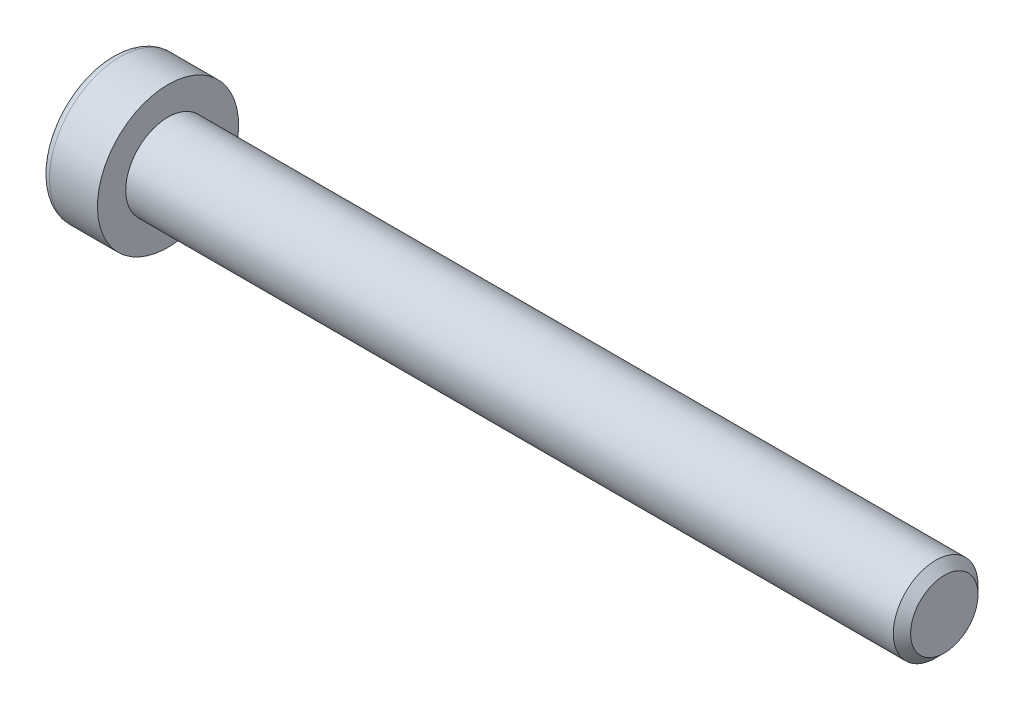
ISO-10303-21;
HEADER;
FILE_DESCRIPTION(('STEP AP214'),'2;1');
FILE_NAME('part.step','',(''),(''),'','','');
FILE_SCHEMA(('AUTOMOTIVE_DESIGN { 1 0 10303 214 1 1 1 1 }'));
ENDSEC;
DATA;
#1=APPLICATION_CONTEXT('core data for automotive mechanical design processes');
#2=APPLICATION_PROTOCOL_DEFINITION('international standard','automotive_design',2000,#1);
#3=PRODUCT_CONTEXT('',#1,'mechanical');
#4=PRODUCT('Part','Part','',(#3));
#5=PRODUCT_RELATED_PRODUCT_CATEGORY('part','',(#4));
#6=PRODUCT_DEFINITION_FORMATION('','',#4);
#7=PRODUCT_DEFINITION_CONTEXT('part definition',#1,'design');
#8=PRODUCT_DEFINITION('design','',#6,#7);
#9=PRODUCT_DEFINITION_SHAPE('','',#8);
#10=(LENGTH_UNIT() NAMED_UNIT(*) SI_UNIT(.MILLI.,.METRE.));
#11=(NAMED_UNIT(*) PLANE_ANGLE_UNIT() SI_UNIT($,.RADIAN.));
#12=(NAMED_UNIT(*) SI_UNIT($,.STERADIAN.) SOLID_ANGLE_UNIT());
#13=UNCERTAINTY_MEASURE_WITH_UNIT(LENGTH_MEASURE(1.E-05),#10,'distance_accuracy_value','');
#14=(GEOMETRIC_REPRESENTATION_CONTEXT(3) GLOBAL_UNCERTAINTY_ASSIGNED_CONTEXT((#13)) GLOBAL_UNIT_ASSIGNED_CONTEXT((#10,
#11,#12)) REPRESENTATION_CONTEXT('',''));
#15=CARTESIAN_POINT('',(0.,0.,0.));
#16=DIRECTION('',(0.,0.,1.));
#17=DIRECTION('',(1.,0.,0.));
#18=AXIS2_PLACEMENT_3D('',#15,#16,#17);
#19=CARTESIAN_POINT('',(-1.0080000013204,0.,0.));
#20=DIRECTION('',(-1.,0.,0.));
#21=DIRECTION('',(0.,0.,1.));
#22=AXIS2_PLACEMENT_3D('',#19,#20,#21);
#23=CONICAL_SURFACE('',#22,2.32325748231688,1.04719754987444);
#24=CARTESIAN_POINT('',(0.333333335277075,-1.13686837721616E-10,0.));
#25=VERTEX_POINT('',#24);
#26=VERTEX_LOOP('',#25);
#27=FACE_BOUND('',#26,.T.);
#28=CARTESIAN_POINT('',(-1.00000000147417,2.00000000033577,1.15470053795369));
#29=CARTESIAN_POINT('',(-0.970695546651424,2.00000000012059,1.05321634683343));
#30=CARTESIAN_POINT('',(-0.944044678605912,2.00000000003232,0.950856145634243));
#31=CARTESIAN_POINT('',(-0.89752638882102,1.9999999999676,0.744363444828041));
#32=CARTESIAN_POINT('',(-0.877675421693126,1.99999999999142,0.640227277439652));
#33=CARTESIAN_POINT('',(-0.846775960221252,2.00000000000837,0.433245449982703));
#34=CARTESIAN_POINT('',(-0.835521788855821,2.00000000000223,0.330431627800687));
#35=CARTESIAN_POINT('',(-0.822089169383493,1.99999999999777,0.124320462828436));
#36=CARTESIAN_POINT('',(-0.819899595237444,1.99999999999944,0.0210238686822163));
#37=CARTESIAN_POINT('',(-0.824466291464269,2.00000000000049,-0.171974735991148));
#38=CARTESIAN_POINT('',(-0.830101286550578,2.00000000000013,-0.261705707531802));
#39=CARTESIAN_POINT('',(-0.847957302108121,1.99999999999987,-0.440583082600117));
#40=CARTESIAN_POINT('',(-0.860184416189506,1.99999999999996,-0.529728867900473));
#41=CARTESIAN_POINT('',(-0.890749834827568,2.00000000000004,-0.70897474722998));
#42=CARTESIAN_POINT('',(-0.909217643745651,2.00000000000002,-0.799052166718215));
#43=CARTESIAN_POINT('',(-0.951131762446776,1.99999999999998,-0.977863889549757));
#44=CARTESIAN_POINT('',(-0.974568230401505,1.99999999999996,-1.06660048191082));
#45=CARTESIAN_POINT('',(-1.0000000016925,2.,-1.15470053794852));
#46=B_SPLINE_CURVE_WITH_KNOTS('',3,(#28,#29,#30,#31,#32,#33,#34,#35,#36,#37,#38,#39,#40,#41,#42,
#43,#44,#45),.UNSPECIFIED.,.F.,.F.,(4,2,2,2,2,2,2,2,4),(0.,0.317016011625951,0.634793817177001,
0.944707606346165,1.25424088912896,1.52370778261223,1.7934241935265,2.06912162198924,
2.3442779727795),.UNSPECIFIED.);
#47=CARTESIAN_POINT('',(-1.00000000167708,1.99999999979036,1.15470053825821));
#48=VERTEX_POINT('',#47);
#49=CARTESIAN_POINT('',(-1.00000000174696,2.,-1.15470053813718));
#50=VERTEX_POINT('',#49);
#51=EDGE_CURVE('E19',#48,#50,#46,.T.);
#52=ORIENTED_EDGE('',*,*,#51,.T.);
#53=CARTESIAN_POINT('',(-1.00000000147417,1.99999999979934,-1.15470053888282));
#54=CARTESIAN_POINT('',(-0.970695546651423,1.91211211209909,-1.2054426342566));
#55=CARTESIAN_POINT('',(-0.944044678605912,1.82346557747997,-1.25662273477975));
#56=CARTESIAN_POINT('',(-0.89752638882102,1.64463765285338,-1.3598690851268));
#57=CARTESIAN_POINT('',(-0.877675421693125,1.5544530864542,-1.41193716884162));
#58=CARTESIAN_POINT('',(-0.846775960221251,1.37520156576323,-1.51542808258477));
#59=CARTESIAN_POINT('',(-0.83552178885582,1.28616218389036,-1.56683499367046));
#60=CARTESIAN_POINT('',(-0.822089169383492,1.10766467901855,-1.66989057615273));
#61=CARTESIAN_POINT('',(-0.819899595237443,1.01820720436435,-1.72153887322728));
#62=CARTESIAN_POINT('',(-0.824466291464268,0.851065509822789,-1.81803817556487));
#63=CARTESIAN_POINT('',(-0.830101286550577,0.773356208962147,-1.86290366133489));
#64=CARTESIAN_POINT('',(-0.84795730210812,0.618443857990577,-1.95234234886882));
#65=CARTESIAN_POINT('',(-0.860184416189505,0.541241343280201,-1.99691524151908));
#66=CARTESIAN_POINT('',(-0.890749834827567,0.386009858257207,-2.0865381811839));
#67=CARTESIAN_POINT('',(-0.90921764374565,0.308000524673037,-2.131576890928));
#68=CARTESIAN_POINT('',(-0.951131762446774,0.153145030206441,-2.22098275234374));
#69=CARTESIAN_POINT('',(-0.974568230401503,0.0762968869764867,-2.26535104852425));
#70=CARTESIAN_POINT('',(-1.0000000016925,3.73024698366476E-10,-2.30940107654314));
#71=B_SPLINE_CURVE_WITH_KNOTS('',3,(#53,#54,#55,#56,#57,#58,#59,#60,#61,#62,#63,#64,#65,#66,#67,
#68,#69,#70),.UNSPECIFIED.,.F.,.F.,(4,2,2,2,2,2,2,2,4),(0.,0.317016011625951,0.634793817177,
0.944707606346164,1.25424088912896,1.52370778261223,1.7934241935265,2.06912162198924,
2.3442779727795),.UNSPECIFIED.);
#72=CARTESIAN_POINT('',(-1.00000000167708,0.,-2.30940107651643));
#73=VERTEX_POINT('',#72);
#74=EDGE_CURVE('E79',#50,#73,#71,.T.);
#75=ORIENTED_EDGE('',*,*,#74,.T.);
#76=CARTESIAN_POINT('',(-1.00000000147417,-5.36430553752716E-10,-2.30940107683651));
#77=CARTESIAN_POINT('',(-0.970695546651424,-0.0878878880215004,-2.25865898109003));
#78=CARTESIAN_POINT('',(-0.944044678605912,-0.176534422552348,-2.20747888041399));
#79=CARTESIAN_POINT('',(-0.89752638882102,-0.355362347114219,-2.10423252995484));
#80=CARTESIAN_POINT('',(-0.877675421693126,-0.445546913537223,-2.05216444628128));
#81=CARTESIAN_POINT('',(-0.846775960221251,-0.624798434245139,-1.94867353256747));
#82=CARTESIAN_POINT('',(-0.83552178885582,-0.713837816111874,-1.89726662147115));
#83=CARTESIAN_POINT('',(-0.822089169383492,-0.89233532097922,-1.79421103898117));
#84=CARTESIAN_POINT('',(-0.819899595237443,-0.981792795635091,-1.7425627419095));
#85=CARTESIAN_POINT('',(-0.824466291464268,-1.1489344901777,-1.64606343957373));
#86=CARTESIAN_POINT('',(-0.830101286550577,-1.22664379103798,-1.60119795380309));
#87=CARTESIAN_POINT('',(-0.84795730210812,-1.38155614200929,-1.51175926626871));
#88=CARTESIAN_POINT('',(-0.860184416189505,-1.45875865671976,-1.46718637361861));
#89=CARTESIAN_POINT('',(-0.890749834827567,-1.61399014174283,-1.37756343395392));
#90=CARTESIAN_POINT('',(-0.90921764374565,-1.69199947532698,-1.33252472420979));
#91=CARTESIAN_POINT('',(-0.951131762446775,-1.84685496979354,-1.24311886279398));
#92=CARTESIAN_POINT('',(-0.974568230401503,-1.92370311302347,-1.19875056661343));
#93=CARTESIAN_POINT('',(-1.0000000016925,-1.99999999962697,-1.15470053859462));
#94=B_SPLINE_CURVE_WITH_KNOTS('',3,(#76,#77,#78,#79,#80,#81,#82,#83,#84,#85,#86,#87,#88,#89,#90,
#91,#92,#93),.UNSPECIFIED.,.F.,.F.,(4,2,2,2,2,2,2,2,4),(0.,0.317016011625951,0.634793817177001,
0.944707606346165,1.25424088912896,1.52370778261223,1.7934241935265,2.06912162198924,
2.3442779727795),.UNSPECIFIED.);
#95=CARTESIAN_POINT('',(-1.00000000167708,-1.99999999979036,-1.15470053825822));
#96=VERTEX_POINT('',#95);
#97=EDGE_CURVE('E104',#73,#96,#94,.T.);
#98=ORIENTED_EDGE('',*,*,#97,.T.);
#99=CARTESIAN_POINT('',(-1.00000000147417,-2.00000000033577,-1.15470053795369));
#100=CARTESIAN_POINT('',(-0.970695546651424,-2.00000000012059,-1.05321634683343));
#101=CARTESIAN_POINT('',(-0.944044678605912,-2.00000000003232,-0.950856145634245));
#102=CARTESIAN_POINT('',(-0.89752638882102,-1.9999999999676,-0.744363444828043));
#103=CARTESIAN_POINT('',(-0.877675421693126,-1.99999999999142,-0.640227277439654));
#104=CARTESIAN_POINT('',(-0.846775960221251,-2.00000000000836,-0.433245449982705));
#105=CARTESIAN_POINT('',(-0.83552178885582,-2.00000000000223,-0.330431627800689));
#106=CARTESIAN_POINT('',(-0.822089169383492,-1.99999999999777,-0.124320462828438));
#107=CARTESIAN_POINT('',(-0.819899595237443,-1.99999999999944,-0.0210238686822187));
#108=CARTESIAN_POINT('',(-0.824466291464268,-2.00000000000049,0.171974735991145));
#109=CARTESIAN_POINT('',(-0.830101286550578,-2.00000000000013,0.261705707531799));
#110=CARTESIAN_POINT('',(-0.84795730210812,-1.99999999999987,0.440583082600114));
#111=CARTESIAN_POINT('',(-0.860184416189505,-1.99999999999996,0.529728867900471));
#112=CARTESIAN_POINT('',(-0.890749834827567,-2.00000000000004,0.708974747229978));
#113=CARTESIAN_POINT('',(-0.90921764374565,-2.00000000000002,0.799052166718213));
#114=CARTESIAN_POINT('',(-0.951131762446775,-1.99999999999998,0.977863889549755));
#115=CARTESIAN_POINT('',(-0.974568230401504,-1.99999999999996,1.06660048191082));
#116=CARTESIAN_POINT('',(-1.0000000016925,-2.,1.15470053794852));
#117=B_SPLINE_CURVE_WITH_KNOTS('',3,(#99,#100,#101,#102,#103,#104,#105,#106,#107,#108,#109,#110,
#111,#112,#113,#114,#115,#116),.UNSPECIFIED.,.F.,.F.,(4,2,2,2,2,2,2,2,4),(0.,0.317016011625951,
0.634793817177001,0.944707606346165,1.25424088912896,1.52370778261223,1.7934241935265,
2.06912162198924,2.3442779727795),.UNSPECIFIED.);
#118=CARTESIAN_POINT('',(-1.00000000167708,-1.99999999979036,1.15470053825822));
#119=VERTEX_POINT('',#118);
#120=EDGE_CURVE('E128',#96,#119,#117,.T.);
#121=ORIENTED_EDGE('',*,*,#120,.T.);
#122=CARTESIAN_POINT('',(-1.00000000147417,-1.99999999979934,1.15470053888282));
#123=CARTESIAN_POINT('',(-0.970695546651424,-1.91211211209909,1.2054426342566));
#124=CARTESIAN_POINT('',(-0.944044678605912,-1.82346557747997,1.25662273477974));
#125=CARTESIAN_POINT('',(-0.89752638882102,-1.64463765285338,1.3598690851268));
#126=CARTESIAN_POINT('',(-0.877675421693125,-1.5544530864542,1.41193716884162));
#127=CARTESIAN_POINT('',(-0.846775960221251,-1.37520156576323,1.51542808258477));
#128=CARTESIAN_POINT('',(-0.83552178885582,-1.28616218389036,1.56683499367046));
#129=CARTESIAN_POINT('',(-0.822089169383492,-1.10766467901855,1.66989057615273));
#130=CARTESIAN_POINT('',(-0.819899595237443,-1.01820720436435,1.72153887322728));
#131=CARTESIAN_POINT('',(-0.824466291464268,-0.85106550982279,1.81803817556487));
#132=CARTESIAN_POINT('',(-0.830101286550577,-0.773356208962147,1.86290366133489));
#133=CARTESIAN_POINT('',(-0.84795730210812,-0.618443857990578,1.95234234886882));
#134=CARTESIAN_POINT('',(-0.860184416189505,-0.541241343280202,1.99691524151908));
#135=CARTESIAN_POINT('',(-0.890749834827567,-0.386009858257207,2.0865381811839));
#136=CARTESIAN_POINT('',(-0.90921764374565,-0.308000524673038,2.131576890928));
#137=CARTESIAN_POINT('',(-0.951131762446775,-0.153145030206442,2.22098275234374));
#138=CARTESIAN_POINT('',(-0.974568230401503,-0.0762968869764879,2.26535104852425));
#139=CARTESIAN_POINT('',(-1.0000000016925,-3.73025682950192E-10,2.30940107654314));
#140=B_SPLINE_CURVE_WITH_KNOTS('',3,(#122,#123,#124,#125,#126,#127,#128,#129,#130,#131,#132,
#133,#134,#135,#136,#137,#138,#139),.UNSPECIFIED.,.F.,.F.,(4,2,2,2,2,2,2,2,4),(0.,
0.317016011625951,0.634793817177001,0.944707606346165,1.25424088912896,1.52370778261223,
1.7934241935265,2.06912162198924,2.3442779727795),.UNSPECIFIED.);
#141=CARTESIAN_POINT('',(-1.00000000167708,0.,2.30940107651643));
#142=VERTEX_POINT('',#141);
#143=EDGE_CURVE('E136',#119,#142,#140,.T.);
#144=ORIENTED_EDGE('',*,*,#143,.T.);
#145=CARTESIAN_POINT('',(-1.00000000147417,5.36430323702404E-10,2.30940107683651));
#146=CARTESIAN_POINT('',(-0.970695546651424,0.0878878880215003,2.25865898109003));
#147=CARTESIAN_POINT('',(-0.944044678605912,0.176534422552348,2.20747888041399));
#148=CARTESIAN_POINT('',(-0.89752638882102,0.355362347114218,2.10423252995484));
#149=CARTESIAN_POINT('',(-0.877675421693125,0.445546913537223,2.05216444628128));
#150=CARTESIAN_POINT('',(-0.846775960221251,0.624798434245139,1.94867353256747));
#151=CARTESIAN_POINT('',(-0.83552178885582,0.713837816111873,1.89726662147115));
#152=CARTESIAN_POINT('',(-0.822089169383491,0.892335320979219,1.79421103898117));
#153=CARTESIAN_POINT('',(-0.819899595237443,0.98179279563509,1.7425627419095));
#154=CARTESIAN_POINT('',(-0.824466291464268,1.1489344901777,1.64606343957372));
#155=CARTESIAN_POINT('',(-0.830101286550577,1.22664379103798,1.60119795380309));
#156=CARTESIAN_POINT('',(-0.847957302108119,1.38155614200929,1.5117592662687));
#157=CARTESIAN_POINT('',(-0.860184416189504,1.45875865671976,1.46718637361861));
#158=CARTESIAN_POINT('',(-0.890749834827566,1.61399014174283,1.37756343395392));
#159=CARTESIAN_POINT('',(-0.909217643745649,1.69199947532698,1.33252472420978));
#160=CARTESIAN_POINT('',(-0.951131762446774,1.84685496979354,1.24311886279398));
#161=CARTESIAN_POINT('',(-0.974568230401503,1.92370311302347,1.19875056661343));
#162=CARTESIAN_POINT('',(-1.0000000016925,1.99999999962697,1.15470053859461));
#163=B_SPLINE_CURVE_WITH_KNOTS('',3,(#145,#146,#147,#148,#149,#150,#151,#152,#153,#154,#155,
#156,#157,#158,#159,#160,#161,#162),.UNSPECIFIED.,.F.,.F.,(4,2,2,2,2,2,2,2,4),(0.,
0.317016011625951,0.634793817177001,0.944707606346165,1.25424088912896,1.52370778261223,
1.7934241935265,2.06912162198924,2.3442779727795),.UNSPECIFIED.);
#164=EDGE_CURVE('E81',#142,#48,#163,.T.);
#165=ORIENTED_EDGE('',*,*,#164,.T.);
#166=EDGE_LOOP('',(#52,#75,#98,#121,#144,#165));
#167=FACE_BOUND('',#166,.T.);
#168=ADVANCED_FACE('F15',(#27,#167),#23,.F.);
#169=CARTESIAN_POINT('',(-3.99999999999999,2.,1.15470053837925));
#170=DIRECTION('',(0.,1.,0.));
#171=DIRECTION('',(0.,0.,1.));
#172=AXIS2_PLACEMENT_3D('',#169,#170,#171);
#173=PLANE('',#172);
#174=DIRECTION('',(1.,0.,0.));
#175=VECTOR('',#174,1.);
#176=CARTESIAN_POINT('',(-3.99999999999999,2.,1.15470053837925));
#177=LINE('',#176,#175);
#178=CARTESIAN_POINT('',(-3.99999999999999,2.,1.15470053837925));
#179=VERTEX_POINT('',#178);
#180=EDGE_CURVE('E83',#48,#179,#177,.F.);
#181=ORIENTED_EDGE('',*,*,#180,.T.);
#182=DIRECTION('',(0.,0.,1.));
#183=VECTOR('',#182,1.);
#184=CARTESIAN_POINT('',(-3.99999999999999,2.,0.));
#185=LINE('',#184,#183);
#186=CARTESIAN_POINT('',(-3.99999999999999,2.,-1.15470053837925));
#187=VERTEX_POINT('',#186);
#188=EDGE_CURVE('E88',#187,#179,#185,.T.);
#189=ORIENTED_EDGE('',*,*,#188,.F.);
#190=DIRECTION('',(1.,0.,0.));
#191=VECTOR('',#190,1.);
#192=CARTESIAN_POINT('',(-3.99999999999999,2.,-1.15470053837925));
#193=LINE('',#192,#191);
#194=EDGE_CURVE('E86',#187,#50,#193,.T.);
#195=ORIENTED_EDGE('',*,*,#194,.T.);
#196=ORIENTED_EDGE('',*,*,#51,.F.);
#197=EDGE_LOOP('',(#181,#189,#195,#196));
#198=FACE_BOUND('',#197,.T.);
#199=ADVANCED_FACE('F75',(#198),#173,.F.);
#200=CARTESIAN_POINT('',(-3.99999999999999,0.,2.3094010767585));
#201=DIRECTION('',(0.,0.500000000000001,0.866025403784438));
#202=DIRECTION('',(0.,-0.866025403784438,0.500000000000001));
#203=AXIS2_PLACEMENT_3D('',#200,#201,#202);
#204=PLANE('',#203);
#205=DIRECTION('',(1.,0.,0.));
#206=VECTOR('',#205,1.);
#207=CARTESIAN_POINT('',(-3.99999999999999,0.,2.3094010767585));
#208=LINE('',#207,#206);
#209=CARTESIAN_POINT('',(-3.99999999999999,0.,2.3094010767585));
#210=VERTEX_POINT('',#209);
#211=EDGE_CURVE('E140',#142,#210,#208,.F.);
#212=ORIENTED_EDGE('',*,*,#211,.T.);
#213=DIRECTION('',(0.,-0.866025403784438,0.500000000000001));
#214=VECTOR('',#213,1.);
#215=CARTESIAN_POINT('',(-3.99999999999999,2.,1.15470053837925));
#216=LINE('',#215,#214);
#217=EDGE_CURVE('E94',#179,#210,#216,.T.);
#218=ORIENTED_EDGE('',*,*,#217,.F.);
#219=ORIENTED_EDGE('',*,*,#180,.F.);
#220=ORIENTED_EDGE('',*,*,#164,.F.);
#221=EDGE_LOOP('',(#212,#218,#219,#220));
#222=FACE_BOUND('',#221,.T.);
#223=ADVANCED_FACE('F144',(#222),#204,.F.);
#224=CARTESIAN_POINT('',(-3.99999999999999,-2.,1.15470053837925));
#225=DIRECTION('',(0.,-0.5,0.866025403784439));
#226=DIRECTION('',(0.,-0.866025403784439,-0.5));
#227=AXIS2_PLACEMENT_3D('',#224,#225,#226);
#228=PLANE('',#227);
#229=DIRECTION('',(1.,0.,0.));
#230=VECTOR('',#229,1.);
#231=CARTESIAN_POINT('',(-3.99999999999999,-2.,1.15470053837925));
#232=LINE('',#231,#230);
#233=CARTESIAN_POINT('',(-3.99999999999999,-2.,1.15470053837925));
#234=VERTEX_POINT('',#233);
#235=EDGE_CURVE('E135',#119,#234,#232,.F.);
#236=ORIENTED_EDGE('',*,*,#235,.T.);
#237=DIRECTION('',(0.,-0.866025403784439,-0.5));
#238=VECTOR('',#237,1.);
#239=CARTESIAN_POINT('',(-3.99999999999999,0.,2.3094010767585));
#240=LINE('',#239,#238);
#241=EDGE_CURVE('E223',#210,#234,#240,.T.);
#242=ORIENTED_EDGE('',*,*,#241,.F.);
#243=ORIENTED_EDGE('',*,*,#211,.F.);
#244=ORIENTED_EDGE('',*,*,#143,.F.);
#245=EDGE_LOOP('',(#236,#242,#243,#244));
#246=FACE_BOUND('',#245,.T.);
#247=ADVANCED_FACE('F124',(#246),#228,.F.);
#248=CARTESIAN_POINT('',(-3.99999999999999,-2.,-1.15470053837925));
#249=DIRECTION('',(0.,-1.,0.));
#250=DIRECTION('',(0.,0.,-1.));
#251=AXIS2_PLACEMENT_3D('',#248,#249,#250);
#252=PLANE('',#251);
#253=DIRECTION('',(1.,0.,0.));
#254=VECTOR('',#253,1.);
#255=CARTESIAN_POINT('',(-3.99999999999999,-2.,-1.15470053837925));
#256=LINE('',#255,#254);
#257=CARTESIAN_POINT('',(-3.99999999999999,-2.,-1.15470053837925));
#258=VERTEX_POINT('',#257);
#259=EDGE_CURVE('E134',#96,#258,#256,.F.);
#260=ORIENTED_EDGE('',*,*,#259,.T.);
#261=DIRECTION('',(0.,0.,1.));
#262=VECTOR('',#261,1.);
#263=CARTESIAN_POINT('',(-3.99999999999999,-2.,0.));
#264=LINE('',#263,#262);
#265=EDGE_CURVE('E220',#234,#258,#264,.F.);
#266=ORIENTED_EDGE('',*,*,#265,.F.);
#267=ORIENTED_EDGE('',*,*,#235,.F.);
#268=ORIENTED_EDGE('',*,*,#120,.F.);
#269=EDGE_LOOP('',(#260,#266,#267,#268));
#270=FACE_BOUND('',#269,.T.);
#271=ADVANCED_FACE('F120',(#270),#252,.F.);
#272=CARTESIAN_POINT('',(-3.99999999999999,0.,-2.3094010767585));
#273=DIRECTION('',(0.,-0.5,-0.866025403784438));
#274=DIRECTION('',(0.,0.866025403784438,-0.5));
#275=AXIS2_PLACEMENT_3D('',#272,#273,#274);
#276=PLANE('',#275);
#277=DIRECTION('',(1.,0.,0.));
#278=VECTOR('',#277,1.);
#279=CARTESIAN_POINT('',(-3.99999999999999,0.,-2.3094010767585));
#280=LINE('',#279,#278);
#281=CARTESIAN_POINT('',(-3.99999999999999,0.,-2.3094010767585));
#282=VERTEX_POINT('',#281);
#283=EDGE_CURVE('E37',#73,#282,#280,.F.);
#284=ORIENTED_EDGE('',*,*,#283,.T.);
#285=DIRECTION('',(0.,0.866025403784438,-0.5));
#286=VECTOR('',#285,1.);
#287=CARTESIAN_POINT('',(-3.99999999999999,-2.,-1.15470053837925));
#288=LINE('',#287,#286);
#289=EDGE_CURVE('E217',#258,#282,#288,.T.);
#290=ORIENTED_EDGE('',*,*,#289,.F.);
#291=ORIENTED_EDGE('',*,*,#259,.F.);
#292=ORIENTED_EDGE('',*,*,#97,.F.);
#293=EDGE_LOOP('',(#284,#290,#291,#292));
#294=FACE_BOUND('',#293,.T.);
#295=ADVANCED_FACE('F114',(#294),#276,.F.);
#296=CARTESIAN_POINT('',(-3.99999999999999,2.,-1.15470053837925));
#297=DIRECTION('',(0.,0.5,-0.866025403784439));
#298=DIRECTION('',(0.,0.866025403784439,0.5));
#299=AXIS2_PLACEMENT_3D('',#296,#297,#298);
#300=PLANE('',#299);
#301=ORIENTED_EDGE('',*,*,#194,.F.);
#302=DIRECTION('',(0.,0.866025403784439,0.5));
#303=VECTOR('',#302,1.);
#304=CARTESIAN_POINT('',(-3.99999999999999,0.,-2.3094010767585));
#305=LINE('',#304,#303);
#306=EDGE_CURVE('E215',#282,#187,#305,.T.);
#307=ORIENTED_EDGE('',*,*,#306,.F.);
#308=ORIENTED_EDGE('',*,*,#283,.F.);
#309=ORIENTED_EDGE('',*,*,#74,.F.);
#310=EDGE_LOOP('',(#301,#307,#308,#309));
#311=FACE_BOUND('',#310,.T.);
#312=ADVANCED_FACE('F92',(#311),#300,.F.);
#313=CARTESIAN_POINT('',(-3.99999999999999,3.65470053837925,0.));
#314=DIRECTION('',(-1.,0.,0.));
#315=DIRECTION('',(0.,0.,1.));
#316=AXIS2_PLACEMENT_3D('',#313,#314,#315);
#317=PLANE('',#316);
#318=ORIENTED_EDGE('',*,*,#289,.T.);
#319=ORIENTED_EDGE('',*,*,#306,.T.);
#320=ORIENTED_EDGE('',*,*,#188,.T.);
#321=ORIENTED_EDGE('',*,*,#217,.T.);
#322=ORIENTED_EDGE('',*,*,#241,.T.);
#323=ORIENTED_EDGE('',*,*,#265,.T.);
#324=EDGE_LOOP('',(#318,#319,#320,#321,#322,#323));
#325=FACE_BOUND('',#324,.T.);
#326=CARTESIAN_POINT('',(-3.99999999999999,0.,0.));
#327=DIRECTION('',(1.,0.,0.));
#328=DIRECTION('',(0.,1.,0.));
#329=AXIS2_PLACEMENT_3D('',#326,#327,#328);
#330=CIRCLE('',#329,4.4);
#331=CARTESIAN_POINT('',(-3.99999999999999,4.4,0.));
#332=VERTEX_POINT('',#331);
#333=EDGE_CURVE('E192',#332,#332,#330,.T.);
#334=ORIENTED_EDGE('',*,*,#333,.F.);
#335=EDGE_LOOP('',(#334));
#336=FACE_BOUND('',#335,.T.);
#337=ADVANCED_FACE('F113',(#325,#336),#317,.T.);
#338=CARTESIAN_POINT('',(-3.4,0.,0.));
#339=DIRECTION('',(1.,0.,0.));
#340=DIRECTION('',(0.,0.,-1.));
#341=AXIS2_PLACEMENT_3D('',#338,#339,#340);
#342=TOROIDAL_SURFACE('',#341,4.4,0.6);
#343=CARTESIAN_POINT('',(-3.4,0.,0.));
#344=DIRECTION('',(1.,0.,0.));
#345=DIRECTION('',(0.,1.,0.));
#346=AXIS2_PLACEMENT_3D('',#343,#344,#345);
#347=CIRCLE('',#346,5.);
#348=CARTESIAN_POINT('',(-3.4,5.,0.));
#349=VERTEX_POINT('',#348);
#350=EDGE_CURVE('E233',#349,#349,#347,.T.);
#351=ORIENTED_EDGE('',*,*,#350,.F.);
#352=EDGE_LOOP('',(#351));
#353=FACE_BOUND('',#352,.T.);
#354=ORIENTED_EDGE('',*,*,#333,.T.);
#355=EDGE_LOOP('',(#354));
#356=FACE_BOUND('',#355,.T.);
#357=ADVANCED_FACE('F176',(#353,#356),#342,.T.);
#358=CARTESIAN_POINT('',(-1.99999999999999,0.,0.));
#359=DIRECTION('',(1.,0.,0.));
#360=DIRECTION('',(0.,1.,0.));
#361=AXIS2_PLACEMENT_3D('',#358,#359,#360);
#362=CYLINDRICAL_SURFACE('',#361,5.);
#363=ORIENTED_EDGE('',*,*,#350,.T.);
#364=EDGE_LOOP('',(#363));
#365=FACE_BOUND('',#364,.T.);
#366=CARTESIAN_POINT('',(0.,0.,0.));
#367=DIRECTION('',(1.,0.,0.));
#368=DIRECTION('',(0.,1.,0.));
#369=AXIS2_PLACEMENT_3D('',#366,#367,#368);
#370=CIRCLE('',#369,5.);
#371=CARTESIAN_POINT('',(0.,5.,0.));
#372=VERTEX_POINT('',#371);
#373=EDGE_CURVE('E102',#372,#372,#370,.T.);
#374=ORIENTED_EDGE('',*,*,#373,.F.);
#375=EDGE_LOOP('',(#374));
#376=FACE_BOUND('',#375,.T.);
#377=ADVANCED_FACE('F173',(#365,#376),#362,.T.);
#378=CARTESIAN_POINT('',(55.,1.5,0.));
#379=DIRECTION('',(1.,0.,0.));
#380=DIRECTION('',(0.,0.,-1.));
#381=AXIS2_PLACEMENT_3D('',#378,#379,#380);
#382=PLANE('',#381);
#383=CARTESIAN_POINT('',(55.000000000291,0.,0.));
#384=DIRECTION('',(-1.,0.,0.));
#385=DIRECTION('',(0.,0.,1.));
#386=AXIS2_PLACEMENT_3D('',#383,#384,#385);
#387=CIRCLE('',#386,2.38655000026711);
#388=CARTESIAN_POINT('',(55.000000000291,0.,2.38655000026711));
#389=VERTEX_POINT('',#388);
#390=EDGE_CURVE('E229',#389,#389,#387,.T.);
#391=ORIENTED_EDGE('',*,*,#390,.F.);
#392=EDGE_LOOP('',(#391));
#393=FACE_BOUND('',#392,.T.);
#394=ADVANCED_FACE('F169',(#393),#382,.T.);
#395=CARTESIAN_POINT('',(0.,4.,0.));
#396=DIRECTION('',(1.,0.,0.));
#397=DIRECTION('',(0.,0.,-1.));
#398=AXIS2_PLACEMENT_3D('',#395,#396,#397);
#399=PLANE('',#398);
#400=CARTESIAN_POINT('',(0.,0.,0.));
#401=DIRECTION('',(1.,0.,0.));
#402=DIRECTION('',(0.,1.,0.));
#403=AXIS2_PLACEMENT_3D('',#400,#401,#402);
#404=CIRCLE('',#403,3.);
#405=CARTESIAN_POINT('',(0.,3.,0.));
#406=VERTEX_POINT('',#405);
#407=EDGE_CURVE('E28',#406,#406,#404,.T.);
#408=ORIENTED_EDGE('',*,*,#407,.F.);
#409=EDGE_LOOP('',(#408));
#410=FACE_BOUND('',#409,.T.);
#411=ORIENTED_EDGE('',*,*,#373,.T.);
#412=EDGE_LOOP('',(#411));
#413=FACE_BOUND('',#412,.T.);
#414=ADVANCED_FACE('F162',(#410,#413),#399,.T.);
#415=CARTESIAN_POINT('',(54.3865499997196,0.,0.));
#416=DIRECTION('',(-1.,0.,0.));
#417=DIRECTION('',(0.,0.,1.));
#418=AXIS2_PLACEMENT_3D('',#415,#416,#417);
#419=CONICAL_SURFACE('',#418,2.99999999970169,0.78539816247083);
#420=ORIENTED_EDGE('',*,*,#390,.T.);
#421=EDGE_LOOP('',(#420));
#422=FACE_BOUND('',#421,.T.);
#423=CARTESIAN_POINT('',(54.38655,0.,0.));
#424=DIRECTION('',(1.,0.,0.));
#425=DIRECTION('',(0.,1.,0.));
#426=AXIS2_PLACEMENT_3D('',#423,#424,#425);
#427=CIRCLE('',#426,3.);
#428=CARTESIAN_POINT('',(54.38655,3.,0.));
#429=VERTEX_POINT('',#428);
#430=EDGE_CURVE('E10',#429,#429,#427,.F.);
#431=ORIENTED_EDGE('',*,*,#430,.F.);
#432=EDGE_LOOP('',(#431));
#433=FACE_BOUND('',#432,.T.);
#434=ADVANCED_FACE('F155',(#422,#433),#419,.T.);
#435=CARTESIAN_POINT('',(46.,0.,0.));
#436=DIRECTION('',(1.,0.,0.));
#437=DIRECTION('',(0.,1.,0.));
#438=AXIS2_PLACEMENT_3D('',#435,#436,#437);
#439=CYLINDRICAL_SURFACE('',#438,3.);
#440=ORIENTED_EDGE('',*,*,#430,.T.);
#441=EDGE_LOOP('',(#440));
#442=FACE_BOUND('',#441,.T.);
#443=ORIENTED_EDGE('',*,*,#407,.T.);
#444=EDGE_LOOP('',(#443));
#445=FACE_BOUND('',#444,.T.);
#446=ADVANCED_FACE('F153',(#442,#445),#439,.T.);
#447=CLOSED_SHELL('',(#168,#199,#223,#247,#271,#295,#312,#337,#357,#377,#394,#414,#434,#446));
#448=MANIFOLD_SOLID_BREP('B1',#447);
#449=ADVANCED_BREP_SHAPE_REPRESENTATION('',(#18,#448),#14);
#450=SHAPE_DEFINITION_REPRESENTATION(#9,#449);
ENDSEC;
END-ISO-10303-21;
